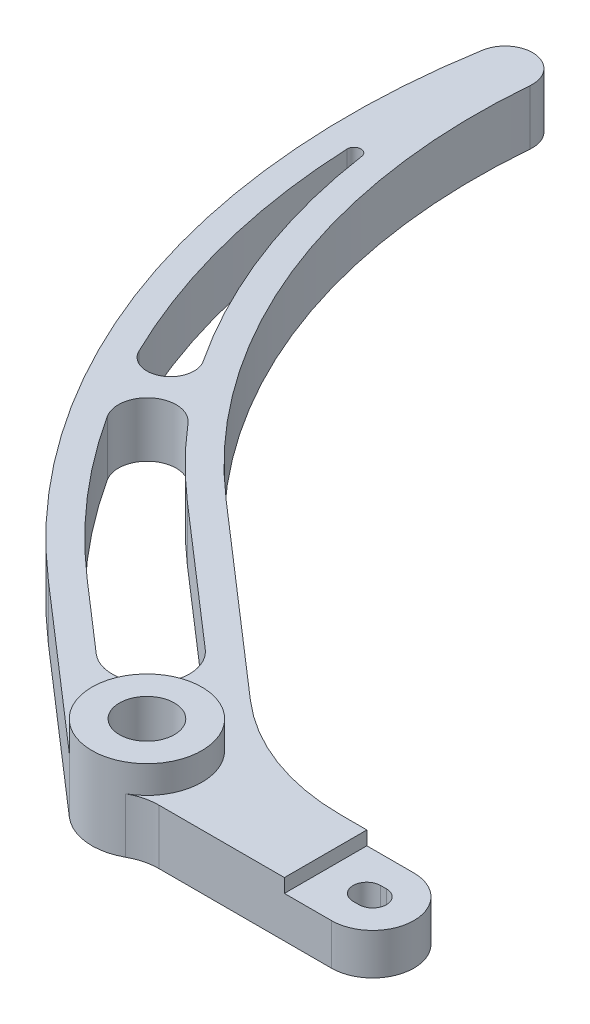
ISO-10303-21;
HEADER;
FILE_DESCRIPTION(('STEP AP214'),'2;1');
FILE_NAME('part.step','',(''),(''),'','','');
FILE_SCHEMA(('AUTOMOTIVE_DESIGN { 1 0 10303 214 1 1 1 1 }'));
ENDSEC;
DATA;
#1=APPLICATION_CONTEXT('core data for automotive mechanical design processes');
#2=APPLICATION_PROTOCOL_DEFINITION('international standard','automotive_design',2000,#1);
#3=PRODUCT_CONTEXT('',#1,'mechanical');
#4=PRODUCT('Part','Part','',(#3));
#5=PRODUCT_RELATED_PRODUCT_CATEGORY('part','',(#4));
#6=PRODUCT_DEFINITION_FORMATION('','',#4);
#7=PRODUCT_DEFINITION_CONTEXT('part definition',#1,'design');
#8=PRODUCT_DEFINITION('design','',#6,#7);
#9=PRODUCT_DEFINITION_SHAPE('','',#8);
#10=(LENGTH_UNIT() NAMED_UNIT(*) SI_UNIT(.MILLI.,.METRE.));
#11=(NAMED_UNIT(*) PLANE_ANGLE_UNIT() SI_UNIT($,.RADIAN.));
#12=(NAMED_UNIT(*) SI_UNIT($,.STERADIAN.) SOLID_ANGLE_UNIT());
#13=UNCERTAINTY_MEASURE_WITH_UNIT(LENGTH_MEASURE(1.E-05),#10,'distance_accuracy_value','');
#14=(GEOMETRIC_REPRESENTATION_CONTEXT(3) GLOBAL_UNCERTAINTY_ASSIGNED_CONTEXT((#13)) GLOBAL_UNIT_ASSIGNED_CONTEXT((#10,
#11,#12)) REPRESENTATION_CONTEXT('',''));
#15=CARTESIAN_POINT('',(0.,0.,0.));
#16=DIRECTION('',(0.,0.,1.));
#17=DIRECTION('',(1.,0.,0.));
#18=AXIS2_PLACEMENT_3D('',#15,#16,#17);
#19=CARTESIAN_POINT('',(1.33990270612822,12.7,165.1));
#20=DIRECTION('',(0.,-1.,0.));
#21=DIRECTION('',(0.,0.,-1.));
#22=AXIS2_PLACEMENT_3D('',#19,#20,#21);
#23=CYLINDRICAL_SURFACE('',#22,9.52500000000001);
#24=CARTESIAN_POINT('',(1.33990270612822,9.525,165.1));
#25=DIRECTION('',(0.,1.,0.));
#26=DIRECTION('',(0.,0.,1.));
#27=AXIS2_PLACEMENT_3D('',#24,#25,#26);
#28=CIRCLE('',#27,9.52500000000001);
#29=CARTESIAN_POINT('',(1.33990270612822,9.525,174.625));
#30=VERTEX_POINT('',#29);
#31=CARTESIAN_POINT('',(1.33990270612822,9.525,155.575));
#32=VERTEX_POINT('',#31);
#33=EDGE_CURVE('E47',#30,#32,#28,.T.);
#34=ORIENTED_EDGE('',*,*,#33,.F.);
#35=DIRECTION('',(0.,-1.,0.));
#36=VECTOR('',#35,1.);
#37=CARTESIAN_POINT('',(1.33990270612822,12.7,174.625));
#38=LINE('',#37,#36);
#39=CARTESIAN_POINT('',(1.33990270612822,0.,174.625));
#40=VERTEX_POINT('',#39);
#41=EDGE_CURVE('E279',#30,#40,#38,.T.);
#42=ORIENTED_EDGE('',*,*,#41,.T.);
#43=CARTESIAN_POINT('',(1.33990270612822,0.,165.1));
#44=DIRECTION('',(0.,1.,0.));
#45=DIRECTION('',(0.,0.,-1.));
#46=AXIS2_PLACEMENT_3D('',#43,#44,#45);
#47=CIRCLE('',#46,9.52500000000001);
#48=CARTESIAN_POINT('',(1.33990270612822,0.,155.575));
#49=VERTEX_POINT('',#48);
#50=EDGE_CURVE('E256',#40,#49,#47,.T.);
#51=ORIENTED_EDGE('',*,*,#50,.T.);
#52=DIRECTION('',(0.,-1.,0.));
#53=VECTOR('',#52,1.);
#54=CARTESIAN_POINT('',(1.33990270612822,12.7,155.575));
#55=LINE('',#54,#53);
#56=EDGE_CURVE('E277',#32,#49,#55,.T.);
#57=ORIENTED_EDGE('',*,*,#56,.F.);
#58=EDGE_LOOP('',(#34,#42,#51,#57));
#59=FACE_BOUND('',#58,.T.);
#60=ADVANCED_FACE('F32',(#59),#23,.T.);
#61=CARTESIAN_POINT('',(0.,12.7,165.1));
#62=DIRECTION('',(0.,-1.,0.));
#63=DIRECTION('',(0.,0.,-1.));
#64=AXIS2_PLACEMENT_3D('',#61,#62,#63);
#65=CYLINDRICAL_SURFACE('',#64,3.17499999999998);
#66=DIRECTION('',(0.,-1.,0.));
#67=VECTOR('',#66,1.);
#68=CARTESIAN_POINT('',(0.,12.7,161.925));
#69=LINE('',#68,#67);
#70=CARTESIAN_POINT('',(0.,9.525,161.925));
#71=VERTEX_POINT('',#70);
#72=CARTESIAN_POINT('',(0.,0.,161.925));
#73=VERTEX_POINT('',#72);
#74=EDGE_CURVE('E304',#71,#73,#69,.T.);
#75=ORIENTED_EDGE('',*,*,#74,.F.);
#76=CARTESIAN_POINT('',(0.,9.525,165.1));
#77=DIRECTION('',(0.,1.,0.));
#78=DIRECTION('',(0.,0.,1.));
#79=AXIS2_PLACEMENT_3D('',#76,#77,#78);
#80=CIRCLE('',#79,3.17499999999998);
#81=CARTESIAN_POINT('',(0.,9.525,168.275));
#82=VERTEX_POINT('',#81);
#83=EDGE_CURVE('E55',#71,#82,#80,.T.);
#84=ORIENTED_EDGE('',*,*,#83,.T.);
#85=DIRECTION('',(0.,-1.,0.));
#86=VECTOR('',#85,1.);
#87=CARTESIAN_POINT('',(0.,12.7,168.275));
#88=LINE('',#87,#86);
#89=CARTESIAN_POINT('',(0.,0.,168.275));
#90=VERTEX_POINT('',#89);
#91=EDGE_CURVE('E323',#82,#90,#88,.T.);
#92=ORIENTED_EDGE('',*,*,#91,.T.);
#93=CARTESIAN_POINT('',(0.,0.,165.1));
#94=DIRECTION('',(0.,1.,0.));
#95=DIRECTION('',(0.,0.,1.));
#96=AXIS2_PLACEMENT_3D('',#93,#94,#95);
#97=CIRCLE('',#96,3.17499999999998);
#98=EDGE_CURVE('E312',#73,#90,#97,.T.);
#99=ORIENTED_EDGE('',*,*,#98,.F.);
#100=EDGE_LOOP('',(#75,#84,#92,#99));
#101=FACE_BOUND('',#100,.T.);
#102=ADVANCED_FACE('F309',(#101),#65,.F.);
#103=CARTESIAN_POINT('',(0.,12.7,168.275));
#104=DIRECTION('',(0.,0.,-1.));
#105=DIRECTION('',(-1.,0.,0.));
#106=AXIS2_PLACEMENT_3D('',#103,#104,#105);
#107=PLANE('',#106);
#108=ORIENTED_EDGE('',*,*,#91,.F.);
#109=DIRECTION('',(1.,0.,0.));
#110=VECTOR('',#109,1.);
#111=CARTESIAN_POINT('',(0.,9.525,168.275));
#112=LINE('',#111,#110);
#113=CARTESIAN_POINT('',(1.33990270612822,9.525,168.275));
#114=VERTEX_POINT('',#113);
#115=EDGE_CURVE('E446',#82,#114,#112,.T.);
#116=ORIENTED_EDGE('',*,*,#115,.T.);
#117=DIRECTION('',(0.,-1.,0.));
#118=VECTOR('',#117,1.);
#119=CARTESIAN_POINT('',(1.33990270612822,12.7,168.275));
#120=LINE('',#119,#118);
#121=CARTESIAN_POINT('',(1.33990270612822,0.,168.275));
#122=VERTEX_POINT('',#121);
#123=EDGE_CURVE('E316',#114,#122,#120,.T.);
#124=ORIENTED_EDGE('',*,*,#123,.T.);
#125=DIRECTION('',(1.,0.,0.));
#126=VECTOR('',#125,1.);
#127=CARTESIAN_POINT('',(0.,0.,168.275));
#128=LINE('',#127,#126);
#129=EDGE_CURVE('E434',#90,#122,#128,.T.);
#130=ORIENTED_EDGE('',*,*,#129,.F.);
#131=EDGE_LOOP('',(#108,#116,#124,#130));
#132=FACE_BOUND('',#131,.T.);
#133=ADVANCED_FACE('F509',(#132),#107,.T.);
#134=CARTESIAN_POINT('',(1.33990270612822,12.7,165.1));
#135=DIRECTION('',(0.,-1.,0.));
#136=DIRECTION('',(0.,0.,-1.));
#137=AXIS2_PLACEMENT_3D('',#134,#135,#136);
#138=CYLINDRICAL_SURFACE('',#137,3.17499999999998);
#139=ORIENTED_EDGE('',*,*,#123,.F.);
#140=CARTESIAN_POINT('',(1.33990270612822,9.525,165.1));
#141=DIRECTION('',(0.,1.,0.));
#142=DIRECTION('',(0.,0.,1.));
#143=AXIS2_PLACEMENT_3D('',#140,#141,#142);
#144=CIRCLE('',#143,3.17499999999998);
#145=CARTESIAN_POINT('',(1.33990270612822,9.525,161.925));
#146=VERTEX_POINT('',#145);
#147=EDGE_CURVE('E444',#114,#146,#144,.T.);
#148=ORIENTED_EDGE('',*,*,#147,.T.);
#149=DIRECTION('',(0.,-1.,0.));
#150=VECTOR('',#149,1.);
#151=CARTESIAN_POINT('',(1.33990270612822,12.7,161.925));
#152=LINE('',#151,#150);
#153=CARTESIAN_POINT('',(1.33990270612822,0.,161.925));
#154=VERTEX_POINT('',#153);
#155=EDGE_CURVE('E306',#146,#154,#152,.T.);
#156=ORIENTED_EDGE('',*,*,#155,.T.);
#157=CARTESIAN_POINT('',(1.33990270612822,0.,165.1));
#158=DIRECTION('',(0.,1.,0.));
#159=DIRECTION('',(0.,0.,1.));
#160=AXIS2_PLACEMENT_3D('',#157,#158,#159);
#161=CIRCLE('',#160,3.17499999999998);
#162=EDGE_CURVE('E318',#122,#154,#161,.T.);
#163=ORIENTED_EDGE('',*,*,#162,.F.);
#164=EDGE_LOOP('',(#139,#148,#156,#163));
#165=FACE_BOUND('',#164,.T.);
#166=ADVANCED_FACE('F443',(#165),#138,.F.);
#167=CARTESIAN_POINT('',(0.,12.7,161.925));
#168=DIRECTION('',(0.,0.,1.));
#169=DIRECTION('',(1.,0.,0.));
#170=AXIS2_PLACEMENT_3D('',#167,#168,#169);
#171=PLANE('',#170);
#172=ORIENTED_EDGE('',*,*,#155,.F.);
#173=DIRECTION('',(-1.,0.,0.));
#174=VECTOR('',#173,1.);
#175=CARTESIAN_POINT('',(0.,9.525,161.925));
#176=LINE('',#175,#174);
#177=EDGE_CURVE('E40',#146,#71,#176,.T.);
#178=ORIENTED_EDGE('',*,*,#177,.T.);
#179=ORIENTED_EDGE('',*,*,#74,.T.);
#180=DIRECTION('',(-1.,0.,0.));
#181=VECTOR('',#180,1.);
#182=CARTESIAN_POINT('',(0.,0.,161.925));
#183=LINE('',#182,#181);
#184=EDGE_CURVE('E314',#154,#73,#183,.T.);
#185=ORIENTED_EDGE('',*,*,#184,.F.);
#186=EDGE_LOOP('',(#172,#178,#179,#185));
#187=FACE_BOUND('',#186,.T.);
#188=ADVANCED_FACE('F302',(#187),#171,.T.);
#189=CARTESIAN_POINT('',(-145.879223198508,12.7,-12.7));
#190=DIRECTION('',(0.,-1.,0.));
#191=DIRECTION('',(0.,0.,-1.));
#192=AXIS2_PLACEMENT_3D('',#189,#190,#191);
#193=PLANE('',#192);
#194=CARTESIAN_POINT('',(-126.721193642061,12.7,83.7360907879204));
#195=DIRECTION('',(0.,1.,0.));
#196=DIRECTION('',(0.,0.,-1.));
#197=AXIS2_PLACEMENT_3D('',#194,#195,#196);
#198=CIRCLE('',#197,5.45709636871345);
#199=CARTESIAN_POINT('',(-131.624484339722,12.7,86.1314281569896));
#200=VERTEX_POINT('',#199);
#201=CARTESIAN_POINT('',(-122.16830383571,12.7,80.7275869756154));
#202=VERTEX_POINT('',#201);
#203=EDGE_CURVE('E417',#200,#202,#198,.T.);
#204=ORIENTED_EDGE('',*,*,#203,.F.);
#205=CARTESIAN_POINT('',(14.8935000837613,12.7,14.5550063271155));
#206=DIRECTION('',(0.,1.,0.));
#207=DIRECTION('',(0.,0.,1.));
#208=AXIS2_PLACEMENT_3D('',#205,#206,#207);
#209=CIRCLE('',#208,163.066562855443);
#210=CARTESIAN_POINT('',(-148.016867664179,12.7,21.6905512760873));
#211=VERTEX_POINT('',#210);
#212=EDGE_CURVE('E391',#211,#200,#209,.T.);
#213=ORIENTED_EDGE('',*,*,#212,.F.);
#214=CARTESIAN_POINT('',(-146.430888268581,12.7,21.6210846888966));
#215=DIRECTION('',(0.,1.,0.));
#216=DIRECTION('',(0.,0.,-1.));
#217=AXIS2_PLACEMENT_3D('',#214,#215,#216);
#218=CIRCLE('',#217,1.58749999999998);
#219=CARTESIAN_POINT('',(-144.860415421427,12.7,21.3891983237218));
#220=VERTEX_POINT('',#219);
#221=EDGE_CURVE('E406',#220,#211,#218,.T.);
#222=ORIENTED_EDGE('',*,*,#221,.F.);
#223=CARTESIAN_POINT('',(0.,12.7,0.));
#224=DIRECTION('',(0.,-1.,0.));
#225=DIRECTION('',(0.,0.,1.));
#226=AXIS2_PLACEMENT_3D('',#223,#224,#225);
#227=CIRCLE('',#226,146.431);
#228=EDGE_CURVE('E420',#202,#220,#227,.T.);
#229=ORIENTED_EDGE('',*,*,#228,.F.);
#230=EDGE_LOOP('',(#204,#213,#222,#229));
#231=FACE_BOUND('',#230,.T.);
#232=DIRECTION('',(0.754709580222773,0.,0.656059028990506));
#233=VECTOR('',#232,1.);
#234=CARTESIAN_POINT('',(-92.0877908039998,12.7,137.622903528117));
#235=LINE('',#234,#233);
#236=CARTESIAN_POINT('',(-92.0877908039998,12.7,137.622903528117));
#237=VERTEX_POINT('',#236);
#238=CARTESIAN_POINT('',(-75.9891210548345,12.7,151.61726363755));
#239=VERTEX_POINT('',#238);
#240=EDGE_CURVE('E375',#237,#239,#235,.T.);
#241=ORIENTED_EDGE('',*,*,#240,.F.);
#242=CARTESIAN_POINT('',(14.8935000837613,12.7,14.5550063271155));
#243=DIRECTION('',(0.,1.,0.));
#244=DIRECTION('',(0.,0.,1.));
#245=AXIS2_PLACEMENT_3D('',#242,#243,#244);
#246=CIRCLE('',#245,163.066562855443);
#247=CARTESIAN_POINT('',(-122.222718656317,12.7,102.815113283266));
#248=VERTEX_POINT('',#247);
#249=EDGE_CURVE('E348',#248,#237,#246,.T.);
#250=ORIENTED_EDGE('',*,*,#249,.F.);
#251=CARTESIAN_POINT('',(-116.613386320555,12.7,99.2044516383051));
#252=DIRECTION('',(0.,1.,0.));
#253=DIRECTION('',(0.,0.,-1.));
#254=AXIS2_PLACEMENT_3D('',#251,#252,#253);
#255=CIRCLE('',#254,6.67094346906177);
#256=CARTESIAN_POINT('',(-111.532318828832,12.7,94.8819246098213));
#257=VERTEX_POINT('',#256);
#258=EDGE_CURVE('E358',#257,#248,#255,.T.);
#259=ORIENTED_EDGE('',*,*,#258,.F.);
#260=CARTESIAN_POINT('',(0.,12.7,0.));
#261=DIRECTION('',(0.,-1.,0.));
#262=DIRECTION('',(0.,0.,1.));
#263=AXIS2_PLACEMENT_3D('',#260,#261,#262);
#264=CIRCLE('',#263,146.431);
#265=CARTESIAN_POINT('',(-96.0673796741088,12.7,110.512878541601));
#266=VERTEX_POINT('',#265);
#267=EDGE_CURVE('E384',#266,#257,#264,.T.);
#268=ORIENTED_EDGE('',*,*,#267,.F.);
#269=DIRECTION('',(-0.754709580222773,0.,-0.656059028990507));
#270=VECTOR('',#269,1.);
#271=CARTESIAN_POINT('',(-64.2788935846227,12.7,138.146187914447));
#272=LINE('',#271,#270);
#273=CARTESIAN_POINT('',(-64.2788935846227,12.7,138.146187914447));
#274=VERTEX_POINT('',#273);
#275=EDGE_CURVE('E381',#274,#266,#272,.T.);
#276=ORIENTED_EDGE('',*,*,#275,.F.);
#277=CARTESIAN_POINT('',(-70.1340073197286,12.7,144.881725775998));
#278=DIRECTION('',(0.,1.,0.));
#279=DIRECTION('',(0.,0.,-1.));
#280=AXIS2_PLACEMENT_3D('',#277,#278,#279);
#281=CIRCLE('',#280,8.92467518374877);
#282=EDGE_CURVE('E378',#239,#274,#281,.T.);
#283=ORIENTED_EDGE('',*,*,#282,.F.);
#284=EDGE_LOOP('',(#241,#250,#259,#268,#276,#283));
#285=FACE_BOUND('',#284,.T.);
#286=DIRECTION('',(1.,0.,0.));
#287=VECTOR('',#286,1.);
#288=CARTESIAN_POINT('',(1.33990270612822,12.7,174.625));
#289=LINE('',#288,#287);
#290=CARTESIAN_POINT('',(-38.5032778757914,12.7,174.625));
#291=VERTEX_POINT('',#290);
#292=CARTESIAN_POINT('',(-9.52500000000001,12.7,174.625));
#293=VERTEX_POINT('',#292);
#294=EDGE_CURVE('E224',#291,#293,#289,.T.);
#295=ORIENTED_EDGE('',*,*,#294,.T.);
#296=DIRECTION('',(0.,0.,1.));
#297=VECTOR('',#296,1.);
#298=CARTESIAN_POINT('',(-9.52500000000001,12.7,150.458461468362));
#299=LINE('',#298,#297);
#300=CARTESIAN_POINT('',(-9.52500000000001,12.7,155.575));
#301=VERTEX_POINT('',#300);
#302=EDGE_CURVE('E212',#301,#293,#299,.T.);
#303=ORIENTED_EDGE('',*,*,#302,.F.);
#304=DIRECTION('',(-1.,0.,0.));
#305=VECTOR('',#304,1.);
#306=CARTESIAN_POINT('',(1.33990270612822,12.7,155.575));
#307=LINE('',#306,#305);
#308=CARTESIAN_POINT('',(-15.5569899676003,12.7,155.575));
#309=VERTEX_POINT('',#308);
#310=EDGE_CURVE('E221',#301,#309,#307,.T.);
#311=ORIENTED_EDGE('',*,*,#310,.T.);
#312=CARTESIAN_POINT('',(-15.5569899676003,12.7,104.775));
#313=DIRECTION('',(0.,-1.,0.));
#314=DIRECTION('',(0.,0.,-1.));
#315=AXIS2_PLACEMENT_3D('',#312,#313,#314);
#316=CIRCLE('',#315,50.8);
#317=CARTESIAN_POINT('',(-48.8847886403181,12.7,143.114246675317));
#318=VERTEX_POINT('',#317);
#319=EDGE_CURVE('E230',#309,#318,#316,.T.);
#320=ORIENTED_EDGE('',*,*,#319,.T.);
#321=DIRECTION('',(-0.754709580222773,0.,-0.656059028990507));
#322=VECTOR('',#321,1.);
#323=CARTESIAN_POINT('',(-91.901404840019,12.7,105.720472707186));
#324=LINE('',#323,#322);
#325=CARTESIAN_POINT('',(-91.9014048400191,12.7,105.720472707186));
#326=VERTEX_POINT('',#325);
#327=EDGE_CURVE('E232',#318,#326,#324,.T.);
#328=ORIENTED_EDGE('',*,*,#327,.T.);
#329=CARTESIAN_POINT('',(0.,12.7,0.));
#330=DIRECTION('',(0.,-1.,0.));
#331=DIRECTION('',(0.,0.,1.));
#332=AXIS2_PLACEMENT_3D('',#329,#330,#331);
#333=CIRCLE('',#332,140.081);
#334=CARTESIAN_POINT('',(-139.553151073681,12.7,-12.1492627927147));
#335=VERTEX_POINT('',#334);
#336=EDGE_CURVE('E239',#326,#335,#333,.T.);
#337=ORIENTED_EDGE('',*,*,#336,.T.);
#338=CARTESIAN_POINT('',(-145.879223198508,12.7,-12.7));
#339=DIRECTION('',(0.,1.,0.));
#340=DIRECTION('',(0.,0.,-1.));
#341=AXIS2_PLACEMENT_3D('',#338,#339,#340);
#342=CIRCLE('',#341,6.35000000000001);
#343=CARTESIAN_POINT('',(-152.139898440356,12.7,-13.7613413758565));
#344=VERTEX_POINT('',#343);
#345=EDGE_CURVE('E267',#335,#344,#342,.T.);
#346=ORIENTED_EDGE('',*,*,#345,.T.);
#347=CARTESIAN_POINT('',(14.8935000837613,12.7,14.5550063271155));
#348=DIRECTION('',(0.,1.,0.));
#349=DIRECTION('',(0.,0.,-1.));
#350=AXIS2_PLACEMENT_3D('',#347,#348,#349);
#351=CIRCLE('',#350,169.416562855443);
#352=CARTESIAN_POINT('',(-96.2537656380895,12.7,142.415309362532));
#353=VERTEX_POINT('',#352);
#354=EDGE_CURVE('E329',#344,#353,#351,.T.);
#355=ORIENTED_EDGE('',*,*,#354,.T.);
#356=DIRECTION('',(0.754709580222773,0.,0.656059028990506));
#357=VECTOR('',#356,1.);
#358=CARTESIAN_POINT('',(-59.1319496681794,12.7,174.684811668829));
#359=LINE('',#358,#357);
#360=CARTESIAN_POINT('',(-59.1319496681794,12.7,174.684811668829));
#361=VERTEX_POINT('',#360);
#362=EDGE_CURVE('E234',#353,#361,#359,.T.);
#363=ORIENTED_EDGE('',*,*,#362,.T.);
#364=CARTESIAN_POINT('',(-50.8,12.7,165.1));
#365=DIRECTION('',(0.,1.,0.));
#366=DIRECTION('',(0.,0.,1.));
#367=AXIS2_PLACEMENT_3D('',#364,#365,#366);
#368=CIRCLE('',#367,12.7);
#369=CARTESIAN_POINT('',(-44.6516389378957,12.7,176.2125));
#370=VERTEX_POINT('',#369);
#371=EDGE_CURVE('E334',#370,#361,#368,.T.);
#372=ORIENTED_EDGE('',*,*,#371,.F.);
#373=CARTESIAN_POINT('',(-38.5032778757914,12.7,187.325));
#374=DIRECTION('',(0.,-1.,0.));
#375=DIRECTION('',(0.,0.,-1.));
#376=AXIS2_PLACEMENT_3D('',#373,#374,#375);
#377=CIRCLE('',#376,12.7);
#378=EDGE_CURVE('E298',#370,#291,#377,.T.);
#379=ORIENTED_EDGE('',*,*,#378,.T.);
#380=EDGE_LOOP('',(#295,#303,#311,#320,#328,#337,#346,#355,#363,#372,#379));
#381=FACE_BOUND('',#380,.T.);
#382=ADVANCED_FACE('F220',(#231,#285,#381),#193,.F.);
#383=CARTESIAN_POINT('',(-145.879223198508,0.,-12.7));
#384=DIRECTION('',(0.,-1.,0.));
#385=DIRECTION('',(0.,0.,-1.));
#386=AXIS2_PLACEMENT_3D('',#383,#384,#385);
#387=PLANE('',#386);
#388=CARTESIAN_POINT('',(14.8935000837613,0.,14.5550063271155));
#389=DIRECTION('',(0.,1.,0.));
#390=DIRECTION('',(0.,0.,1.));
#391=AXIS2_PLACEMENT_3D('',#388,#389,#390);
#392=CIRCLE('',#391,163.066562855443);
#393=CARTESIAN_POINT('',(-122.222718656317,0.,102.815113283266));
#394=VERTEX_POINT('',#393);
#395=CARTESIAN_POINT('',(-92.0877908039998,0.,137.622903528117));
#396=VERTEX_POINT('',#395);
#397=EDGE_CURVE('E354',#394,#396,#392,.T.);
#398=ORIENTED_EDGE('',*,*,#397,.T.);
#399=DIRECTION('',(0.754709580222773,0.,0.656059028990506));
#400=VECTOR('',#399,1.);
#401=CARTESIAN_POINT('',(-92.0877908039998,0.,137.622903528117));
#402=LINE('',#401,#400);
#403=CARTESIAN_POINT('',(-75.9891210548345,0.,151.61726363755));
#404=VERTEX_POINT('',#403);
#405=EDGE_CURVE('E357',#396,#404,#402,.T.);
#406=ORIENTED_EDGE('',*,*,#405,.T.);
#407=CARTESIAN_POINT('',(-70.1340073197286,0.,144.881725775998));
#408=DIRECTION('',(0.,1.,0.));
#409=DIRECTION('',(0.,0.,-1.));
#410=AXIS2_PLACEMENT_3D('',#407,#408,#409);
#411=CIRCLE('',#410,8.92467518374877);
#412=CARTESIAN_POINT('',(-64.2788935846227,0.,138.146187914447));
#413=VERTEX_POINT('',#412);
#414=EDGE_CURVE('E361',#404,#413,#411,.T.);
#415=ORIENTED_EDGE('',*,*,#414,.T.);
#416=DIRECTION('',(-0.754709580222773,0.,-0.656059028990507));
#417=VECTOR('',#416,1.);
#418=CARTESIAN_POINT('',(-64.2788935846227,0.,138.146187914447));
#419=LINE('',#418,#417);
#420=CARTESIAN_POINT('',(-96.0673796741088,0.,110.512878541601));
#421=VERTEX_POINT('',#420);
#422=EDGE_CURVE('E364',#413,#421,#419,.T.);
#423=ORIENTED_EDGE('',*,*,#422,.T.);
#424=CARTESIAN_POINT('',(0.,0.,0.));
#425=DIRECTION('',(0.,-1.,0.));
#426=DIRECTION('',(0.,0.,1.));
#427=AXIS2_PLACEMENT_3D('',#424,#425,#426);
#428=CIRCLE('',#427,146.431);
#429=CARTESIAN_POINT('',(-111.532318828832,0.,94.8819246098213));
#430=VERTEX_POINT('',#429);
#431=EDGE_CURVE('E367',#421,#430,#428,.T.);
#432=ORIENTED_EDGE('',*,*,#431,.T.);
#433=CARTESIAN_POINT('',(-116.613386320555,0.,99.2044516383051));
#434=DIRECTION('',(0.,1.,0.));
#435=DIRECTION('',(0.,0.,-1.));
#436=AXIS2_PLACEMENT_3D('',#433,#434,#435);
#437=CIRCLE('',#436,6.67094346906177);
#438=EDGE_CURVE('E370',#430,#394,#437,.T.);
#439=ORIENTED_EDGE('',*,*,#438,.T.);
#440=EDGE_LOOP('',(#398,#406,#415,#423,#432,#439));
#441=FACE_BOUND('',#440,.T.);
#442=CARTESIAN_POINT('',(14.8935000837613,0.,14.5550063271155));
#443=DIRECTION('',(0.,1.,0.));
#444=DIRECTION('',(0.,0.,1.));
#445=AXIS2_PLACEMENT_3D('',#442,#443,#444);
#446=CIRCLE('',#445,163.066562855443);
#447=CARTESIAN_POINT('',(-148.016867664179,0.,21.6905512760873));
#448=VERTEX_POINT('',#447);
#449=CARTESIAN_POINT('',(-131.624484339722,0.,86.1314281569896));
#450=VERTEX_POINT('',#449);
#451=EDGE_CURVE('E402',#448,#450,#446,.T.);
#452=ORIENTED_EDGE('',*,*,#451,.T.);
#453=CARTESIAN_POINT('',(-126.721193642061,0.,83.7360907879204));
#454=DIRECTION('',(0.,1.,0.));
#455=DIRECTION('',(0.,0.,-1.));
#456=AXIS2_PLACEMENT_3D('',#453,#454,#455);
#457=CIRCLE('',#456,5.45709636871345);
#458=CARTESIAN_POINT('',(-122.16830383571,0.,80.7275869756154));
#459=VERTEX_POINT('',#458);
#460=EDGE_CURVE('E405',#450,#459,#457,.T.);
#461=ORIENTED_EDGE('',*,*,#460,.T.);
#462=CARTESIAN_POINT('',(0.,0.,0.));
#463=DIRECTION('',(0.,-1.,0.));
#464=DIRECTION('',(0.,0.,1.));
#465=AXIS2_PLACEMENT_3D('',#462,#463,#464);
#466=CIRCLE('',#465,146.431);
#467=CARTESIAN_POINT('',(-144.860415421427,0.,21.3891983237218));
#468=VERTEX_POINT('',#467);
#469=EDGE_CURVE('E409',#459,#468,#466,.T.);
#470=ORIENTED_EDGE('',*,*,#469,.T.);
#471=CARTESIAN_POINT('',(-146.430888268581,0.,21.6210846888966));
#472=DIRECTION('',(0.,1.,0.));
#473=DIRECTION('',(0.,0.,-1.));
#474=AXIS2_PLACEMENT_3D('',#471,#472,#473);
#475=CIRCLE('',#474,1.58749999999998);
#476=EDGE_CURVE('E412',#468,#448,#475,.T.);
#477=ORIENTED_EDGE('',*,*,#476,.T.);
#478=EDGE_LOOP('',(#452,#461,#470,#477));
#479=FACE_BOUND('',#478,.T.);
#480=CARTESIAN_POINT('',(-145.879223198508,0.,-12.7));
#481=DIRECTION('',(0.,1.,0.));
#482=DIRECTION('',(0.,0.,-1.));
#483=AXIS2_PLACEMENT_3D('',#480,#481,#482);
#484=CIRCLE('',#483,6.35000000000001);
#485=CARTESIAN_POINT('',(-139.553151073681,0.,-12.1492627927147));
#486=VERTEX_POINT('',#485);
#487=CARTESIAN_POINT('',(-152.139898440356,0.,-13.7613413758565));
#488=VERTEX_POINT('',#487);
#489=EDGE_CURVE('E242',#486,#488,#484,.T.);
#490=ORIENTED_EDGE('',*,*,#489,.F.);
#491=CARTESIAN_POINT('',(0.,0.,0.));
#492=DIRECTION('',(0.,-1.,0.));
#493=DIRECTION('',(0.,0.,1.));
#494=AXIS2_PLACEMENT_3D('',#491,#492,#493);
#495=CIRCLE('',#494,140.081);
#496=CARTESIAN_POINT('',(-91.9014048400191,0.,105.720472707186));
#497=VERTEX_POINT('',#496);
#498=EDGE_CURVE('E265',#497,#486,#495,.T.);
#499=ORIENTED_EDGE('',*,*,#498,.F.);
#500=DIRECTION('',(-0.754709580222773,0.,-0.656059028990507));
#501=VECTOR('',#500,1.);
#502=CARTESIAN_POINT('',(-91.901404840019,0.,105.720472707186));
#503=LINE('',#502,#501);
#504=CARTESIAN_POINT('',(-48.8847886403181,0.,143.114246675317));
#505=VERTEX_POINT('',#504);
#506=EDGE_CURVE('E263',#505,#497,#503,.T.);
#507=ORIENTED_EDGE('',*,*,#506,.F.);
#508=CARTESIAN_POINT('',(-15.5569899676003,0.,104.775));
#509=DIRECTION('',(0.,-1.,0.));
#510=DIRECTION('',(0.,0.,-1.));
#511=AXIS2_PLACEMENT_3D('',#508,#509,#510);
#512=CIRCLE('',#511,50.8);
#513=CARTESIAN_POINT('',(-15.5569899676003,0.,155.575));
#514=VERTEX_POINT('',#513);
#515=EDGE_CURVE('E261',#514,#505,#512,.T.);
#516=ORIENTED_EDGE('',*,*,#515,.F.);
#517=DIRECTION('',(-1.,0.,0.));
#518=VECTOR('',#517,1.);
#519=CARTESIAN_POINT('',(1.33990270612822,0.,155.575));
#520=LINE('',#519,#518);
#521=EDGE_CURVE('E259',#49,#514,#520,.T.);
#522=ORIENTED_EDGE('',*,*,#521,.F.);
#523=ORIENTED_EDGE('',*,*,#50,.F.);
#524=DIRECTION('',(1.,0.,0.));
#525=VECTOR('',#524,1.);
#526=CARTESIAN_POINT('',(1.33990270612822,0.,174.625));
#527=LINE('',#526,#525);
#528=CARTESIAN_POINT('',(-38.5032778757914,0.,174.625));
#529=VERTEX_POINT('',#528);
#530=EDGE_CURVE('E253',#529,#40,#527,.T.);
#531=ORIENTED_EDGE('',*,*,#530,.F.);
#532=CARTESIAN_POINT('',(-38.5032778757914,0.,187.325));
#533=DIRECTION('',(0.,-1.,0.));
#534=DIRECTION('',(0.,0.,-1.));
#535=AXIS2_PLACEMENT_3D('',#532,#533,#534);
#536=CIRCLE('',#535,12.7);
#537=CARTESIAN_POINT('',(-44.6516389378957,0.,176.2125));
#538=VERTEX_POINT('',#537);
#539=EDGE_CURVE('E296',#529,#538,#536,.F.);
#540=ORIENTED_EDGE('',*,*,#539,.T.);
#541=CARTESIAN_POINT('',(-50.8,0.,165.1));
#542=DIRECTION('',(0.,1.,0.));
#543=DIRECTION('',(0.,0.,-1.));
#544=AXIS2_PLACEMENT_3D('',#541,#542,#543);
#545=CIRCLE('',#544,12.7);
#546=CARTESIAN_POINT('',(-59.1319496681794,0.,174.684811668829));
#547=VERTEX_POINT('',#546);
#548=EDGE_CURVE('E250',#547,#538,#545,.T.);
#549=ORIENTED_EDGE('',*,*,#548,.F.);
#550=DIRECTION('',(0.754709580222773,0.,0.656059028990506));
#551=VECTOR('',#550,1.);
#552=CARTESIAN_POINT('',(-59.1319496681794,0.,174.684811668829));
#553=LINE('',#552,#551);
#554=CARTESIAN_POINT('',(-96.2537656380895,0.,142.415309362532));
#555=VERTEX_POINT('',#554);
#556=EDGE_CURVE('E248',#555,#547,#553,.T.);
#557=ORIENTED_EDGE('',*,*,#556,.F.);
#558=CARTESIAN_POINT('',(14.8935000837613,0.,14.5550063271155));
#559=DIRECTION('',(0.,1.,0.));
#560=DIRECTION('',(0.,0.,-1.));
#561=AXIS2_PLACEMENT_3D('',#558,#559,#560);
#562=CIRCLE('',#561,169.416562855443);
#563=EDGE_CURVE('E245',#488,#555,#562,.T.);
#564=ORIENTED_EDGE('',*,*,#563,.F.);
#565=EDGE_LOOP('',(#490,#499,#507,#516,#522,#523,#531,#540,#549,#557,#564));
#566=FACE_BOUND('',#565,.T.);
#567=CARTESIAN_POINT('',(-50.8,0.,165.1));
#568=DIRECTION('',(0.,1.,0.));
#569=DIRECTION('',(0.,0.,1.));
#570=AXIS2_PLACEMENT_3D('',#567,#568,#569);
#571=CIRCLE('',#570,6.35);
#572=CARTESIAN_POINT('',(-50.8,0.,171.45));
#573=VERTEX_POINT('',#572);
#574=EDGE_CURVE('E246',#573,#573,#571,.T.);
#575=ORIENTED_EDGE('',*,*,#574,.T.);
#576=EDGE_LOOP('',(#575));
#577=FACE_BOUND('',#576,.T.);
#578=ORIENTED_EDGE('',*,*,#184,.T.);
#579=ORIENTED_EDGE('',*,*,#98,.T.);
#580=ORIENTED_EDGE('',*,*,#129,.T.);
#581=ORIENTED_EDGE('',*,*,#162,.T.);
#582=EDGE_LOOP('',(#578,#579,#580,#581));
#583=FACE_BOUND('',#582,.T.);
#584=ADVANCED_FACE('F439',(#441,#479,#566,#577,#583),#387,.T.);
#585=CARTESIAN_POINT('',(-145.879223198508,12.7,-12.7));
#586=DIRECTION('',(0.,-1.,0.));
#587=DIRECTION('',(0.,0.,-1.));
#588=AXIS2_PLACEMENT_3D('',#585,#586,#587);
#589=CYLINDRICAL_SURFACE('',#588,6.35000000000001);
#590=ORIENTED_EDGE('',*,*,#489,.T.);
#591=DIRECTION('',(0.,-1.,0.));
#592=VECTOR('',#591,1.);
#593=CARTESIAN_POINT('',(-152.139898440356,12.7,-13.7613413758565));
#594=LINE('',#593,#592);
#595=EDGE_CURVE('E287',#344,#488,#594,.T.);
#596=ORIENTED_EDGE('',*,*,#595,.F.);
#597=ORIENTED_EDGE('',*,*,#345,.F.);
#598=DIRECTION('',(0.,-1.,0.));
#599=VECTOR('',#598,1.);
#600=CARTESIAN_POINT('',(-139.553151073681,12.7,-12.1492627927147));
#601=LINE('',#600,#599);
#602=EDGE_CURVE('E241',#335,#486,#601,.T.);
#603=ORIENTED_EDGE('',*,*,#602,.T.);
#604=EDGE_LOOP('',(#590,#596,#597,#603));
#605=FACE_BOUND('',#604,.T.);
#606=ADVANCED_FACE('F488',(#605),#589,.T.);
#607=CARTESIAN_POINT('',(14.8935000837613,12.7,14.5550063271155));
#608=DIRECTION('',(0.,-1.,0.));
#609=DIRECTION('',(0.,0.,-1.));
#610=AXIS2_PLACEMENT_3D('',#607,#608,#609);
#611=CYLINDRICAL_SURFACE('',#610,169.416562855443);
#612=ORIENTED_EDGE('',*,*,#563,.T.);
#613=DIRECTION('',(0.,-1.,0.));
#614=VECTOR('',#613,1.);
#615=CARTESIAN_POINT('',(-96.2537656380895,12.7,142.415309362532));
#616=LINE('',#615,#614);
#617=EDGE_CURVE('E284',#353,#555,#616,.T.);
#618=ORIENTED_EDGE('',*,*,#617,.F.);
#619=ORIENTED_EDGE('',*,*,#354,.F.);
#620=ORIENTED_EDGE('',*,*,#595,.T.);
#621=EDGE_LOOP('',(#612,#618,#619,#620));
#622=FACE_BOUND('',#621,.T.);
#623=ADVANCED_FACE('F490',(#622),#611,.T.);
#624=CARTESIAN_POINT('',(-59.1319496681794,12.7,174.684811668829));
#625=DIRECTION('',(0.656059028990506,0.,-0.754709580222773));
#626=DIRECTION('',(-0.754709580222774,0.,-0.656059028990506));
#627=AXIS2_PLACEMENT_3D('',#624,#625,#626);
#628=PLANE('',#627);
#629=ORIENTED_EDGE('',*,*,#556,.T.);
#630=DIRECTION('',(0.,-1.,0.));
#631=VECTOR('',#630,1.);
#632=CARTESIAN_POINT('',(-59.1319496681794,12.7,174.684811668829));
#633=LINE('',#632,#631);
#634=EDGE_CURVE('E281',#361,#547,#633,.T.);
#635=ORIENTED_EDGE('',*,*,#634,.F.);
#636=ORIENTED_EDGE('',*,*,#362,.F.);
#637=ORIENTED_EDGE('',*,*,#617,.T.);
#638=EDGE_LOOP('',(#629,#635,#636,#637));
#639=FACE_BOUND('',#638,.T.);
#640=ADVANCED_FACE('F337',(#639),#628,.F.);
#641=CARTESIAN_POINT('',(-50.8,12.7,165.1));
#642=DIRECTION('',(0.,-1.,0.));
#643=DIRECTION('',(0.,0.,-1.));
#644=AXIS2_PLACEMENT_3D('',#641,#642,#643);
#645=CYLINDRICAL_SURFACE('',#644,12.7);
#646=ORIENTED_EDGE('',*,*,#548,.T.);
#647=DIRECTION('',(0.,-1.,0.));
#648=VECTOR('',#647,1.);
#649=CARTESIAN_POINT('',(-44.6516389378957,12.7,176.2125));
#650=LINE('',#649,#648);
#651=EDGE_CURVE('E293',#538,#370,#650,.F.);
#652=ORIENTED_EDGE('',*,*,#651,.T.);
#653=ORIENTED_EDGE('',*,*,#371,.T.);
#654=ORIENTED_EDGE('',*,*,#634,.T.);
#655=EDGE_LOOP('',(#646,#652,#653,#654));
#656=FACE_BOUND('',#655,.T.);
#657=CARTESIAN_POINT('',(-50.8,19.05,165.1));
#658=DIRECTION('',(0.,1.,0.));
#659=DIRECTION('',(0.,0.,1.));
#660=AXIS2_PLACEMENT_3D('',#657,#658,#659);
#661=CIRCLE('',#660,12.7);
#662=CARTESIAN_POINT('',(-50.8,19.05,177.8));
#663=VERTEX_POINT('',#662);
#664=EDGE_CURVE('E344',#663,#663,#661,.T.);
#665=ORIENTED_EDGE('',*,*,#664,.F.);
#666=EDGE_LOOP('',(#665));
#667=FACE_BOUND('',#666,.T.);
#668=ADVANCED_FACE('F341',(#656,#667),#645,.T.);
#669=CARTESIAN_POINT('',(1.33990270612822,12.7,174.625));
#670=DIRECTION('',(0.,0.,-1.));
#671=DIRECTION('',(-1.,0.,0.));
#672=AXIS2_PLACEMENT_3D('',#669,#670,#671);
#673=PLANE('',#672);
#674=DIRECTION('',(1.,0.,0.));
#675=VECTOR('',#674,1.);
#676=CARTESIAN_POINT('',(1.33990270612822,9.525,174.625));
#677=LINE('',#676,#675);
#678=CARTESIAN_POINT('',(-9.52500000000001,9.525,174.625));
#679=VERTEX_POINT('',#678);
#680=EDGE_CURVE('E455',#679,#30,#677,.T.);
#681=ORIENTED_EDGE('',*,*,#680,.F.);
#682=DIRECTION('',(0.,1.,0.));
#683=VECTOR('',#682,1.);
#684=CARTESIAN_POINT('',(-9.52500000000001,12.7,174.625));
#685=LINE('',#684,#683);
#686=EDGE_CURVE('E351',#679,#293,#685,.T.);
#687=ORIENTED_EDGE('',*,*,#686,.T.);
#688=ORIENTED_EDGE('',*,*,#294,.F.);
#689=DIRECTION('',(0.,1.,0.));
#690=VECTOR('',#689,1.);
#691=CARTESIAN_POINT('',(-38.5032778757914,0.,174.625));
#692=LINE('',#691,#690);
#693=EDGE_CURVE('E290',#291,#529,#692,.F.);
#694=ORIENTED_EDGE('',*,*,#693,.T.);
#695=ORIENTED_EDGE('',*,*,#530,.T.);
#696=ORIENTED_EDGE('',*,*,#41,.F.);
#697=EDGE_LOOP('',(#681,#687,#688,#694,#695,#696));
#698=FACE_BOUND('',#697,.T.);
#699=ADVANCED_FACE('F459',(#698),#673,.F.);
#700=CARTESIAN_POINT('',(1.33990270612822,12.7,155.575));
#701=DIRECTION('',(0.,0.,1.));
#702=DIRECTION('',(1.,0.,0.));
#703=AXIS2_PLACEMENT_3D('',#700,#701,#702);
#704=PLANE('',#703);
#705=ORIENTED_EDGE('',*,*,#310,.F.);
#706=DIRECTION('',(0.,-1.,0.));
#707=VECTOR('',#706,1.);
#708=CARTESIAN_POINT('',(-9.52500000000001,12.7,155.575));
#709=LINE('',#708,#707);
#710=CARTESIAN_POINT('',(-9.52500000000001,9.525,155.575));
#711=VERTEX_POINT('',#710);
#712=EDGE_CURVE('E11',#301,#711,#709,.T.);
#713=ORIENTED_EDGE('',*,*,#712,.T.);
#714=DIRECTION('',(-1.,0.,0.));
#715=VECTOR('',#714,1.);
#716=CARTESIAN_POINT('',(1.33990270612822,9.525,155.575));
#717=LINE('',#716,#715);
#718=EDGE_CURVE('E452',#32,#711,#717,.T.);
#719=ORIENTED_EDGE('',*,*,#718,.F.);
#720=ORIENTED_EDGE('',*,*,#56,.T.);
#721=ORIENTED_EDGE('',*,*,#521,.T.);
#722=DIRECTION('',(0.,-1.,0.));
#723=VECTOR('',#722,1.);
#724=CARTESIAN_POINT('',(-15.5569899676003,12.7,155.575));
#725=LINE('',#724,#723);
#726=EDGE_CURVE('E228',#309,#514,#725,.T.);
#727=ORIENTED_EDGE('',*,*,#726,.F.);
#728=EDGE_LOOP('',(#705,#713,#719,#720,#721,#727));
#729=FACE_BOUND('',#728,.T.);
#730=ADVANCED_FACE('F226',(#729),#704,.F.);
#731=CARTESIAN_POINT('',(-15.5569899676003,12.7,104.775));
#732=DIRECTION('',(0.,-1.,0.));
#733=DIRECTION('',(0.,0.,-1.));
#734=AXIS2_PLACEMENT_3D('',#731,#732,#733);
#735=CYLINDRICAL_SURFACE('',#734,50.8);
#736=ORIENTED_EDGE('',*,*,#515,.T.);
#737=DIRECTION('',(0.,-1.,0.));
#738=VECTOR('',#737,1.);
#739=CARTESIAN_POINT('',(-48.8847886403181,12.7,143.114246675317));
#740=LINE('',#739,#738);
#741=EDGE_CURVE('E273',#318,#505,#740,.T.);
#742=ORIENTED_EDGE('',*,*,#741,.F.);
#743=ORIENTED_EDGE('',*,*,#319,.F.);
#744=ORIENTED_EDGE('',*,*,#726,.T.);
#745=EDGE_LOOP('',(#736,#742,#743,#744));
#746=FACE_BOUND('',#745,.T.);
#747=ADVANCED_FACE('F474',(#746),#735,.F.);
#748=CARTESIAN_POINT('',(-91.901404840019,12.7,105.720472707186));
#749=DIRECTION('',(-0.656059028990507,0.,0.754709580222772));
#750=DIRECTION('',(0.754709580222773,0.,0.656059028990507));
#751=AXIS2_PLACEMENT_3D('',#748,#749,#750);
#752=PLANE('',#751);
#753=ORIENTED_EDGE('',*,*,#506,.T.);
#754=DIRECTION('',(0.,-1.,0.));
#755=VECTOR('',#754,1.);
#756=CARTESIAN_POINT('',(-91.9014048400191,12.7,105.720472707186));
#757=LINE('',#756,#755);
#758=EDGE_CURVE('E270',#326,#497,#757,.T.);
#759=ORIENTED_EDGE('',*,*,#758,.F.);
#760=ORIENTED_EDGE('',*,*,#327,.F.);
#761=ORIENTED_EDGE('',*,*,#741,.T.);
#762=EDGE_LOOP('',(#753,#759,#760,#761));
#763=FACE_BOUND('',#762,.T.);
#764=ADVANCED_FACE('F481',(#763),#752,.F.);
#765=CARTESIAN_POINT('',(0.,12.7,0.));
#766=DIRECTION('',(0.,-1.,0.));
#767=DIRECTION('',(0.,0.,-1.));
#768=AXIS2_PLACEMENT_3D('',#765,#766,#767);
#769=CYLINDRICAL_SURFACE('',#768,140.081);
#770=ORIENTED_EDGE('',*,*,#498,.T.);
#771=ORIENTED_EDGE('',*,*,#602,.F.);
#772=ORIENTED_EDGE('',*,*,#336,.F.);
#773=ORIENTED_EDGE('',*,*,#758,.T.);
#774=EDGE_LOOP('',(#770,#771,#772,#773));
#775=FACE_BOUND('',#774,.T.);
#776=ADVANCED_FACE('F484',(#775),#769,.F.);
#777=CARTESIAN_POINT('',(-50.8,12.7,165.1));
#778=DIRECTION('',(0.,-1.,0.));
#779=DIRECTION('',(0.,0.,-1.));
#780=AXIS2_PLACEMENT_3D('',#777,#778,#779);
#781=CYLINDRICAL_SURFACE('',#780,6.35);
#782=ORIENTED_EDGE('',*,*,#574,.F.);
#783=EDGE_LOOP('',(#782));
#784=FACE_BOUND('',#783,.T.);
#785=CARTESIAN_POINT('',(-50.8,19.05,165.1));
#786=DIRECTION('',(0.,1.,0.));
#787=DIRECTION('',(0.,0.,1.));
#788=AXIS2_PLACEMENT_3D('',#785,#786,#787);
#789=CIRCLE('',#788,6.34999999999999);
#790=CARTESIAN_POINT('',(-50.8,19.05,171.45));
#791=VERTEX_POINT('',#790);
#792=EDGE_CURVE('E345',#791,#791,#789,.T.);
#793=ORIENTED_EDGE('',*,*,#792,.T.);
#794=EDGE_LOOP('',(#793));
#795=FACE_BOUND('',#794,.T.);
#796=ADVANCED_FACE('F537',(#784,#795),#781,.F.);
#797=CARTESIAN_POINT('',(14.8935000837613,0.,14.5550063271155));
#798=DIRECTION('',(0.,1.,0.));
#799=DIRECTION('',(0.,0.,1.));
#800=AXIS2_PLACEMENT_3D('',#797,#798,#799);
#801=CYLINDRICAL_SURFACE('',#800,163.066562855443);
#802=ORIENTED_EDGE('',*,*,#212,.T.);
#803=DIRECTION('',(0.,1.,0.));
#804=VECTOR('',#803,1.);
#805=CARTESIAN_POINT('',(-131.624484339722,0.,86.1314281569896));
#806=LINE('',#805,#804);
#807=EDGE_CURVE('E415',#450,#200,#806,.T.);
#808=ORIENTED_EDGE('',*,*,#807,.F.);
#809=ORIENTED_EDGE('',*,*,#451,.F.);
#810=DIRECTION('',(0.,1.,0.));
#811=VECTOR('',#810,1.);
#812=CARTESIAN_POINT('',(-148.016867664179,0.,21.6905512760873));
#813=LINE('',#812,#811);
#814=EDGE_CURVE('E425',#448,#211,#813,.T.);
#815=ORIENTED_EDGE('',*,*,#814,.T.);
#816=EDGE_LOOP('',(#802,#808,#809,#815));
#817=FACE_BOUND('',#816,.T.);
#818=ADVANCED_FACE('F589',(#817),#801,.F.);
#819=CARTESIAN_POINT('',(-146.430888268581,0.,21.6210846888966));
#820=DIRECTION('',(0.,1.,0.));
#821=DIRECTION('',(0.,0.,1.));
#822=AXIS2_PLACEMENT_3D('',#819,#820,#821);
#823=CYLINDRICAL_SURFACE('',#822,1.58749999999998);
#824=ORIENTED_EDGE('',*,*,#221,.T.);
#825=ORIENTED_EDGE('',*,*,#814,.F.);
#826=ORIENTED_EDGE('',*,*,#476,.F.);
#827=DIRECTION('',(0.,1.,0.));
#828=VECTOR('',#827,1.);
#829=CARTESIAN_POINT('',(-144.860415421427,0.,21.3891983237218));
#830=LINE('',#829,#828);
#831=EDGE_CURVE('E427',#468,#220,#830,.T.);
#832=ORIENTED_EDGE('',*,*,#831,.T.);
#833=EDGE_LOOP('',(#824,#825,#826,#832));
#834=FACE_BOUND('',#833,.T.);
#835=ADVANCED_FACE('F594',(#834),#823,.F.);
#836=CARTESIAN_POINT('',(0.,0.,0.));
#837=DIRECTION('',(0.,1.,0.));
#838=DIRECTION('',(0.,0.,1.));
#839=AXIS2_PLACEMENT_3D('',#836,#837,#838);
#840=CYLINDRICAL_SURFACE('',#839,146.431);
#841=ORIENTED_EDGE('',*,*,#228,.T.);
#842=ORIENTED_EDGE('',*,*,#831,.F.);
#843=ORIENTED_EDGE('',*,*,#469,.F.);
#844=DIRECTION('',(0.,1.,0.));
#845=VECTOR('',#844,1.);
#846=CARTESIAN_POINT('',(-122.16830383571,0.,80.7275869756154));
#847=LINE('',#846,#845);
#848=EDGE_CURVE('E429',#459,#202,#847,.T.);
#849=ORIENTED_EDGE('',*,*,#848,.T.);
#850=EDGE_LOOP('',(#841,#842,#843,#849));
#851=FACE_BOUND('',#850,.T.);
#852=ADVANCED_FACE('F604',(#851),#840,.T.);
#853=CARTESIAN_POINT('',(-126.721193642061,0.,83.7360907879204));
#854=DIRECTION('',(0.,1.,0.));
#855=DIRECTION('',(0.,0.,1.));
#856=AXIS2_PLACEMENT_3D('',#853,#854,#855);
#857=CYLINDRICAL_SURFACE('',#856,5.45709636871345);
#858=ORIENTED_EDGE('',*,*,#203,.T.);
#859=ORIENTED_EDGE('',*,*,#848,.F.);
#860=ORIENTED_EDGE('',*,*,#460,.F.);
#861=ORIENTED_EDGE('',*,*,#807,.T.);
#862=EDGE_LOOP('',(#858,#859,#860,#861));
#863=FACE_BOUND('',#862,.T.);
#864=ADVANCED_FACE('F614',(#863),#857,.F.);
#865=CARTESIAN_POINT('',(14.8935000837613,0.,14.5550063271155));
#866=DIRECTION('',(0.,1.,0.));
#867=DIRECTION('',(0.,0.,1.));
#868=AXIS2_PLACEMENT_3D('',#865,#866,#867);
#869=CYLINDRICAL_SURFACE('',#868,163.066562855443);
#870=ORIENTED_EDGE('',*,*,#249,.T.);
#871=DIRECTION('',(0.,1.,0.));
#872=VECTOR('',#871,1.);
#873=CARTESIAN_POINT('',(-92.0877908039998,0.,137.622903528117));
#874=LINE('',#873,#872);
#875=EDGE_CURVE('E373',#396,#237,#874,.T.);
#876=ORIENTED_EDGE('',*,*,#875,.F.);
#877=ORIENTED_EDGE('',*,*,#397,.F.);
#878=DIRECTION('',(0.,1.,0.));
#879=VECTOR('',#878,1.);
#880=CARTESIAN_POINT('',(-122.222718656317,0.,102.815113283266));
#881=LINE('',#880,#879);
#882=EDGE_CURVE('E389',#394,#248,#881,.T.);
#883=ORIENTED_EDGE('',*,*,#882,.T.);
#884=EDGE_LOOP('',(#870,#876,#877,#883));
#885=FACE_BOUND('',#884,.T.);
#886=ADVANCED_FACE('F624',(#885),#869,.F.);
#887=CARTESIAN_POINT('',(-116.613386320555,0.,99.2044516383051));
#888=DIRECTION('',(0.,1.,0.));
#889=DIRECTION('',(0.,0.,1.));
#890=AXIS2_PLACEMENT_3D('',#887,#888,#889);
#891=CYLINDRICAL_SURFACE('',#890,6.67094346906177);
#892=ORIENTED_EDGE('',*,*,#258,.T.);
#893=ORIENTED_EDGE('',*,*,#882,.F.);
#894=ORIENTED_EDGE('',*,*,#438,.F.);
#895=DIRECTION('',(0.,1.,0.));
#896=VECTOR('',#895,1.);
#897=CARTESIAN_POINT('',(-111.532318828832,0.,94.8819246098213));
#898=LINE('',#897,#896);
#899=EDGE_CURVE('E392',#430,#257,#898,.T.);
#900=ORIENTED_EDGE('',*,*,#899,.T.);
#901=EDGE_LOOP('',(#892,#893,#894,#900));
#902=FACE_BOUND('',#901,.T.);
#903=ADVANCED_FACE('F634',(#902),#891,.F.);
#904=CARTESIAN_POINT('',(0.,0.,0.));
#905=DIRECTION('',(0.,1.,0.));
#906=DIRECTION('',(0.,0.,1.));
#907=AXIS2_PLACEMENT_3D('',#904,#905,#906);
#908=CYLINDRICAL_SURFACE('',#907,146.431);
#909=ORIENTED_EDGE('',*,*,#267,.T.);
#910=ORIENTED_EDGE('',*,*,#899,.F.);
#911=ORIENTED_EDGE('',*,*,#431,.F.);
#912=DIRECTION('',(0.,1.,0.));
#913=VECTOR('',#912,1.);
#914=CARTESIAN_POINT('',(-96.0673796741088,0.,110.512878541601));
#915=LINE('',#914,#913);
#916=EDGE_CURVE('E394',#421,#266,#915,.T.);
#917=ORIENTED_EDGE('',*,*,#916,.T.);
#918=EDGE_LOOP('',(#909,#910,#911,#917));
#919=FACE_BOUND('',#918,.T.);
#920=ADVANCED_FACE('F644',(#919),#908,.T.);
#921=CARTESIAN_POINT('',(-64.2788935846227,0.,138.146187914447));
#922=DIRECTION('',(0.656059028990507,0.,-0.754709580222773));
#923=DIRECTION('',(-0.754709580222773,0.,-0.656059028990507));
#924=AXIS2_PLACEMENT_3D('',#921,#922,#923);
#925=PLANE('',#924);
#926=ORIENTED_EDGE('',*,*,#275,.T.);
#927=ORIENTED_EDGE('',*,*,#916,.F.);
#928=ORIENTED_EDGE('',*,*,#422,.F.);
#929=DIRECTION('',(0.,1.,0.));
#930=VECTOR('',#929,1.);
#931=CARTESIAN_POINT('',(-64.2788935846227,0.,138.146187914447));
#932=LINE('',#931,#930);
#933=EDGE_CURVE('E396',#413,#274,#932,.T.);
#934=ORIENTED_EDGE('',*,*,#933,.T.);
#935=EDGE_LOOP('',(#926,#927,#928,#934));
#936=FACE_BOUND('',#935,.T.);
#937=ADVANCED_FACE('F654',(#936),#925,.F.);
#938=CARTESIAN_POINT('',(-70.1340073197286,0.,144.881725775998));
#939=DIRECTION('',(0.,1.,0.));
#940=DIRECTION('',(0.,0.,1.));
#941=AXIS2_PLACEMENT_3D('',#938,#939,#940);
#942=CYLINDRICAL_SURFACE('',#941,8.92467518374877);
#943=ORIENTED_EDGE('',*,*,#282,.T.);
#944=ORIENTED_EDGE('',*,*,#933,.F.);
#945=ORIENTED_EDGE('',*,*,#414,.F.);
#946=DIRECTION('',(0.,1.,0.));
#947=VECTOR('',#946,1.);
#948=CARTESIAN_POINT('',(-75.9891210548345,0.,151.61726363755));
#949=LINE('',#948,#947);
#950=EDGE_CURVE('E398',#404,#239,#949,.T.);
#951=ORIENTED_EDGE('',*,*,#950,.T.);
#952=EDGE_LOOP('',(#943,#944,#945,#951));
#953=FACE_BOUND('',#952,.T.);
#954=ADVANCED_FACE('F501',(#953),#942,.F.);
#955=CARTESIAN_POINT('',(-92.0877908039998,0.,137.622903528117));
#956=DIRECTION('',(-0.656059028990505,0.,0.754709580222773));
#957=DIRECTION('',(0.754709580222774,0.,0.656059028990506));
#958=AXIS2_PLACEMENT_3D('',#955,#956,#957);
#959=PLANE('',#958);
#960=ORIENTED_EDGE('',*,*,#240,.T.);
#961=ORIENTED_EDGE('',*,*,#950,.F.);
#962=ORIENTED_EDGE('',*,*,#405,.F.);
#963=ORIENTED_EDGE('',*,*,#875,.T.);
#964=EDGE_LOOP('',(#960,#961,#962,#963));
#965=FACE_BOUND('',#964,.T.);
#966=ADVANCED_FACE('F494',(#965),#959,.F.);
#967=CARTESIAN_POINT('',(-38.5032778757914,12.7,187.325));
#968=DIRECTION('',(0.,-1.,0.));
#969=DIRECTION('',(0.,0.,-1.));
#970=AXIS2_PLACEMENT_3D('',#967,#968,#969);
#971=CYLINDRICAL_SURFACE('',#970,12.7);
#972=ORIENTED_EDGE('',*,*,#378,.F.);
#973=ORIENTED_EDGE('',*,*,#651,.F.);
#974=ORIENTED_EDGE('',*,*,#539,.F.);
#975=ORIENTED_EDGE('',*,*,#693,.F.);
#976=EDGE_LOOP('',(#972,#973,#974,#975));
#977=FACE_BOUND('',#976,.T.);
#978=ADVANCED_FACE('F34',(#977),#971,.F.);
#979=CARTESIAN_POINT('',(-50.8,19.05,165.1));
#980=DIRECTION('',(0.,1.,0.));
#981=DIRECTION('',(0.,0.,1.));
#982=AXIS2_PLACEMENT_3D('',#979,#980,#981);
#983=PLANE('',#982);
#984=ORIENTED_EDGE('',*,*,#664,.T.);
#985=EDGE_LOOP('',(#984));
#986=FACE_BOUND('',#985,.T.);
#987=ORIENTED_EDGE('',*,*,#792,.F.);
#988=EDGE_LOOP('',(#987));
#989=FACE_BOUND('',#988,.T.);
#990=ADVANCED_FACE('F493',(#986,#989),#983,.T.);
#991=CARTESIAN_POINT('',(-9.52500000000001,9.525,150.458461468362));
#992=DIRECTION('',(-1.,0.,0.));
#993=DIRECTION('',(0.,0.,1.));
#994=AXIS2_PLACEMENT_3D('',#991,#992,#993);
#995=PLANE('',#994);
#996=DIRECTION('',(0.,0.,1.));
#997=VECTOR('',#996,1.);
#998=CARTESIAN_POINT('',(-9.52500000000001,9.525,150.458461468362));
#999=LINE('',#998,#997);
#1000=EDGE_CURVE('E215',#711,#679,#999,.T.);
#1001=ORIENTED_EDGE('',*,*,#1000,.F.);
#1002=ORIENTED_EDGE('',*,*,#712,.F.);
#1003=ORIENTED_EDGE('',*,*,#302,.T.);
#1004=ORIENTED_EDGE('',*,*,#686,.F.);
#1005=EDGE_LOOP('',(#1001,#1002,#1003,#1004));
#1006=FACE_BOUND('',#1005,.T.);
#1007=ADVANCED_FACE('F211',(#1006),#995,.F.);
#1008=CARTESIAN_POINT('',(0.,9.525,0.));
#1009=DIRECTION('',(0.,1.,0.));
#1010=DIRECTION('',(0.,0.,1.));
#1011=AXIS2_PLACEMENT_3D('',#1008,#1009,#1010);
#1012=PLANE('',#1011);
#1013=ORIENTED_EDGE('',*,*,#177,.F.);
#1014=ORIENTED_EDGE('',*,*,#147,.F.);
#1015=ORIENTED_EDGE('',*,*,#115,.F.);
#1016=ORIENTED_EDGE('',*,*,#83,.F.);
#1017=EDGE_LOOP('',(#1013,#1014,#1015,#1016));
#1018=FACE_BOUND('',#1017,.T.);
#1019=ORIENTED_EDGE('',*,*,#680,.T.);
#1020=ORIENTED_EDGE('',*,*,#33,.T.);
#1021=ORIENTED_EDGE('',*,*,#718,.T.);
#1022=ORIENTED_EDGE('',*,*,#1000,.T.);
#1023=EDGE_LOOP('',(#1019,#1020,#1021,#1022));
#1024=FACE_BOUND('',#1023,.T.);
#1025=ADVANCED_FACE('F462',(#1018,#1024),#1012,.T.);
#1026=CLOSED_SHELL('',(#60,#102,#133,#166,#188,#382,#584,#606,#623,#640,#668,#699,#730,#747,
#764,#776,#796,#818,#835,#852,#864,#886,#903,#920,#937,#954,#966,#978,#990,#1007,#1025));
#1027=MANIFOLD_SOLID_BREP('B2',#1026);
#1028=ADVANCED_BREP_SHAPE_REPRESENTATION('',(#18,#1027),#14);
#1029=SHAPE_DEFINITION_REPRESENTATION(#9,#1028);
ENDSEC;
END-ISO-10303-21;
